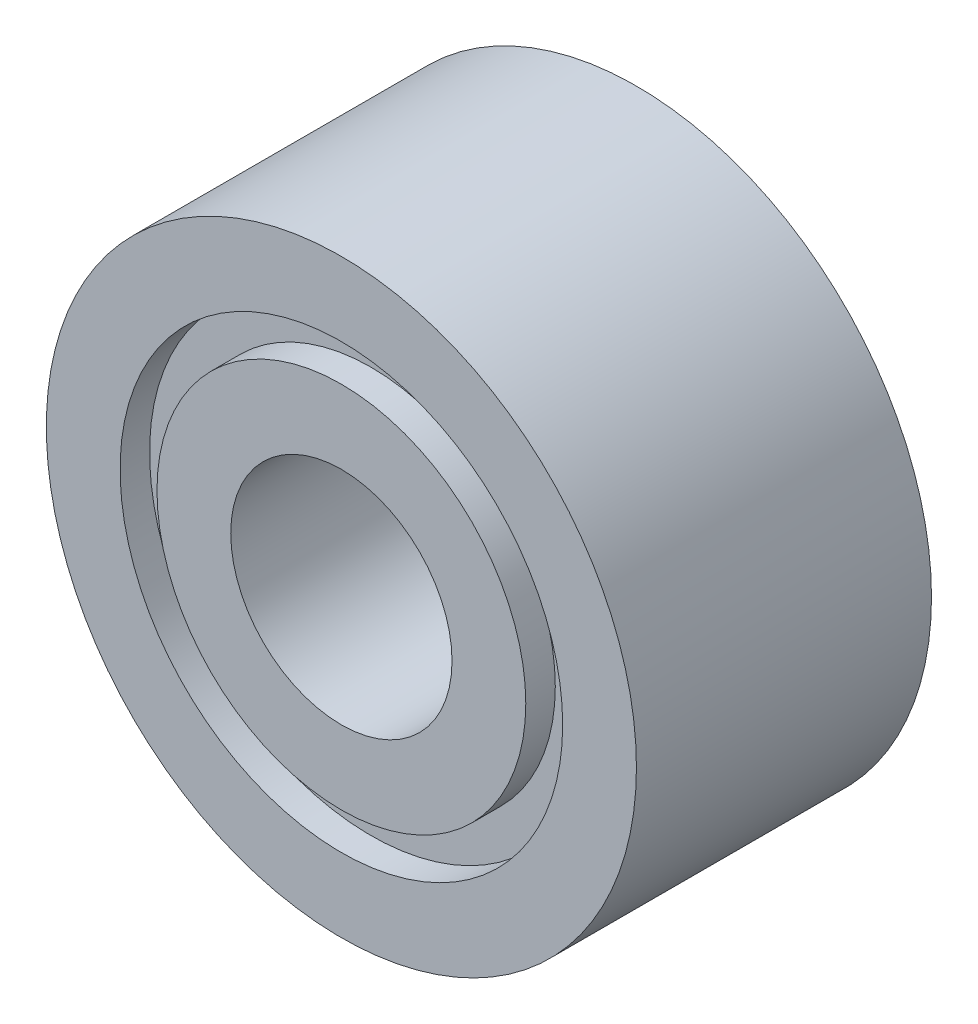
ISO-10303-21;
HEADER;
FILE_DESCRIPTION(('STEP AP214'),'2;1');
FILE_NAME('part.step','',(''),(''),'','','');
FILE_SCHEMA(('AUTOMOTIVE_DESIGN { 1 0 10303 214 1 1 1 1 }'));
ENDSEC;
DATA;
#1=APPLICATION_CONTEXT('core data for automotive mechanical design processes');
#2=APPLICATION_PROTOCOL_DEFINITION('international standard','automotive_design',2000,#1);
#3=PRODUCT_CONTEXT('',#1,'mechanical');
#4=PRODUCT('Part','Part','',(#3));
#5=PRODUCT_RELATED_PRODUCT_CATEGORY('part','',(#4));
#6=PRODUCT_DEFINITION_FORMATION('','',#4);
#7=PRODUCT_DEFINITION_CONTEXT('part definition',#1,'design');
#8=PRODUCT_DEFINITION('design','',#6,#7);
#9=PRODUCT_DEFINITION_SHAPE('','',#8);
#10=(LENGTH_UNIT() NAMED_UNIT(*) SI_UNIT(.MILLI.,.METRE.));
#11=(NAMED_UNIT(*) PLANE_ANGLE_UNIT() SI_UNIT($,.RADIAN.));
#12=(NAMED_UNIT(*) SI_UNIT($,.STERADIAN.) SOLID_ANGLE_UNIT());
#13=UNCERTAINTY_MEASURE_WITH_UNIT(LENGTH_MEASURE(1.E-05),#10,'distance_accuracy_value','');
#14=(GEOMETRIC_REPRESENTATION_CONTEXT(3) GLOBAL_UNCERTAINTY_ASSIGNED_CONTEXT((#13)) GLOBAL_UNIT_ASSIGNED_CONTEXT((#10,
#11,#12)) REPRESENTATION_CONTEXT('',''));
#15=CARTESIAN_POINT('',(0.,0.,0.));
#16=DIRECTION('',(0.,0.,1.));
#17=DIRECTION('',(1.,0.,0.));
#18=AXIS2_PLACEMENT_3D('',#15,#16,#17);
#19=CARTESIAN_POINT('',(0.,1.5,-1.10919002990261));
#20=DIRECTION('',(0.,0.,-1.));
#21=DIRECTION('',(-1.,0.,0.));
#22=AXIS2_PLACEMENT_3D('',#19,#20,#21);
#23=PLANE('',#22);
#24=CARTESIAN_POINT('',(0.,0.,-1.10919002990261));
#25=DIRECTION('',(0.,0.,1.));
#26=DIRECTION('',(1.,0.,0.));
#27=AXIS2_PLACEMENT_3D('',#24,#25,#26);
#28=CIRCLE('',#27,1.5);
#29=CARTESIAN_POINT('',(1.5,0.,-1.10919002990261));
#30=VERTEX_POINT('',#29);
#31=EDGE_CURVE('E90',#30,#30,#28,.T.);
#32=ORIENTED_EDGE('',*,*,#31,.F.);
#33=EDGE_LOOP('',(#32));
#34=FACE_BOUND('',#33,.T.);
#35=CARTESIAN_POINT('',(0.,0.,-1.10919002990261));
#36=DIRECTION('',(0.,0.,1.));
#37=DIRECTION('',(1.,0.,0.));
#38=AXIS2_PLACEMENT_3D('',#35,#36,#37);
#39=CIRCLE('',#38,2.);
#40=CARTESIAN_POINT('',(2.,0.,-1.10919002990261));
#41=VERTEX_POINT('',#40);
#42=EDGE_CURVE('E10',#41,#41,#39,.T.);
#43=ORIENTED_EDGE('',*,*,#42,.T.);
#44=EDGE_LOOP('',(#43));
#45=FACE_BOUND('',#44,.T.);
#46=ADVANCED_FACE('F39',(#34,#45),#23,.F.);
#47=CARTESIAN_POINT('',(0.,0.,0.));
#48=DIRECTION('',(0.,0.,1.));
#49=DIRECTION('',(1.,0.,0.));
#50=AXIS2_PLACEMENT_3D('',#47,#48,#49);
#51=CYLINDRICAL_SURFACE('',#50,2.);
#52=ORIENTED_EDGE('',*,*,#42,.F.);
#53=EDGE_LOOP('',(#52));
#54=FACE_BOUND('',#53,.T.);
#55=CARTESIAN_POINT('',(0.,0.,-3.10919002990261));
#56=DIRECTION('',(0.,0.,1.));
#57=DIRECTION('',(1.,0.,0.));
#58=AXIS2_PLACEMENT_3D('',#55,#56,#57);
#59=CIRCLE('',#58,2.);
#60=CARTESIAN_POINT('',(2.,0.,-3.10919002990261));
#61=VERTEX_POINT('',#60);
#62=EDGE_CURVE('E46',#61,#61,#59,.T.);
#63=ORIENTED_EDGE('',*,*,#62,.T.);
#64=EDGE_LOOP('',(#63));
#65=FACE_BOUND('',#64,.T.);
#66=ADVANCED_FACE('F98',(#54,#65),#51,.T.);
#67=CARTESIAN_POINT('',(0.,2.,-3.10919002990261));
#68=DIRECTION('',(0.,0.,1.));
#69=DIRECTION('',(1.,0.,0.));
#70=AXIS2_PLACEMENT_3D('',#67,#68,#69);
#71=PLANE('',#70);
#72=ORIENTED_EDGE('',*,*,#62,.F.);
#73=EDGE_LOOP('',(#72));
#74=FACE_BOUND('',#73,.T.);
#75=CARTESIAN_POINT('',(0.,0.,-3.10919002990261));
#76=DIRECTION('',(0.,0.,1.));
#77=DIRECTION('',(1.,0.,0.));
#78=AXIS2_PLACEMENT_3D('',#75,#76,#77);
#79=CIRCLE('',#78,1.5);
#80=CARTESIAN_POINT('',(1.5,0.,-3.10919002990261));
#81=VERTEX_POINT('',#80);
#82=EDGE_CURVE('E51',#81,#81,#79,.T.);
#83=ORIENTED_EDGE('',*,*,#82,.T.);
#84=EDGE_LOOP('',(#83));
#85=FACE_BOUND('',#84,.T.);
#86=ADVANCED_FACE('F102',(#74,#85),#71,.F.);
#87=CARTESIAN_POINT('',(0.,0.,0.));
#88=DIRECTION('',(0.,0.,1.));
#89=DIRECTION('',(1.,0.,0.));
#90=AXIS2_PLACEMENT_3D('',#87,#88,#89);
#91=CYLINDRICAL_SURFACE('',#90,1.5);
#92=ORIENTED_EDGE('',*,*,#82,.F.);
#93=EDGE_LOOP('',(#92));
#94=FACE_BOUND('',#93,.T.);
#95=CARTESIAN_POINT('',(0.,0.,-2.90919002990261));
#96=DIRECTION('',(0.,0.,1.));
#97=DIRECTION('',(1.,0.,0.));
#98=AXIS2_PLACEMENT_3D('',#95,#96,#97);
#99=CIRCLE('',#98,1.5);
#100=CARTESIAN_POINT('',(1.5,0.,-2.90919002990261));
#101=VERTEX_POINT('',#100);
#102=EDGE_CURVE('E56',#101,#101,#99,.T.);
#103=ORIENTED_EDGE('',*,*,#102,.T.);
#104=EDGE_LOOP('',(#103));
#105=FACE_BOUND('',#104,.T.);
#106=ADVANCED_FACE('F107',(#94,#105),#91,.F.);
#107=CARTESIAN_POINT('',(0.,1.5,-2.90919002990261));
#108=DIRECTION('',(0.,0.,1.));
#109=DIRECTION('',(1.,0.,0.));
#110=AXIS2_PLACEMENT_3D('',#107,#108,#109);
#111=PLANE('',#110);
#112=ORIENTED_EDGE('',*,*,#102,.F.);
#113=EDGE_LOOP('',(#112));
#114=FACE_BOUND('',#113,.T.);
#115=CARTESIAN_POINT('',(0.,0.,-2.90919002990261));
#116=DIRECTION('',(0.,0.,1.));
#117=DIRECTION('',(1.,0.,0.));
#118=AXIS2_PLACEMENT_3D('',#115,#116,#117);
#119=CIRCLE('',#118,1.25);
#120=CARTESIAN_POINT('',(1.25,0.,-2.90919002990261));
#121=VERTEX_POINT('',#120);
#122=EDGE_CURVE('E62',#121,#121,#119,.T.);
#123=ORIENTED_EDGE('',*,*,#122,.T.);
#124=EDGE_LOOP('',(#123));
#125=FACE_BOUND('',#124,.T.);
#126=ADVANCED_FACE('F113',(#114,#125),#111,.F.);
#127=CARTESIAN_POINT('',(0.,0.,0.));
#128=DIRECTION('',(0.,0.,1.));
#129=DIRECTION('',(1.,0.,0.));
#130=AXIS2_PLACEMENT_3D('',#127,#128,#129);
#131=CYLINDRICAL_SURFACE('',#130,1.25);
#132=ORIENTED_EDGE('',*,*,#122,.F.);
#133=EDGE_LOOP('',(#132));
#134=FACE_BOUND('',#133,.T.);
#135=CARTESIAN_POINT('',(0.,0.,-3.10919002990261));
#136=DIRECTION('',(0.,0.,1.));
#137=DIRECTION('',(1.,0.,0.));
#138=AXIS2_PLACEMENT_3D('',#135,#136,#137);
#139=CIRCLE('',#138,1.25);
#140=CARTESIAN_POINT('',(1.25,0.,-3.10919002990261));
#141=VERTEX_POINT('',#140);
#142=EDGE_CURVE('E66',#141,#141,#139,.T.);
#143=ORIENTED_EDGE('',*,*,#142,.T.);
#144=EDGE_LOOP('',(#143));
#145=FACE_BOUND('',#144,.T.);
#146=ADVANCED_FACE('F117',(#134,#145),#131,.T.);
#147=CARTESIAN_POINT('',(0.,1.25,-3.10919002990261));
#148=DIRECTION('',(0.,0.,1.));
#149=DIRECTION('',(1.,0.,0.));
#150=AXIS2_PLACEMENT_3D('',#147,#148,#149);
#151=PLANE('',#150);
#152=ORIENTED_EDGE('',*,*,#142,.F.);
#153=EDGE_LOOP('',(#152));
#154=FACE_BOUND('',#153,.T.);
#155=CARTESIAN_POINT('',(0.,0.,-3.10919002990261));
#156=DIRECTION('',(0.,0.,1.));
#157=DIRECTION('',(1.,0.,0.));
#158=AXIS2_PLACEMENT_3D('',#155,#156,#157);
#159=CIRCLE('',#158,0.75);
#160=CARTESIAN_POINT('',(0.75,0.,-3.10919002990261));
#161=VERTEX_POINT('',#160);
#162=EDGE_CURVE('E70',#161,#161,#159,.T.);
#163=ORIENTED_EDGE('',*,*,#162,.T.);
#164=EDGE_LOOP('',(#163));
#165=FACE_BOUND('',#164,.T.);
#166=ADVANCED_FACE('F121',(#154,#165),#151,.F.);
#167=CARTESIAN_POINT('',(0.,0.,0.));
#168=DIRECTION('',(0.,0.,1.));
#169=DIRECTION('',(1.,0.,0.));
#170=AXIS2_PLACEMENT_3D('',#167,#168,#169);
#171=CYLINDRICAL_SURFACE('',#170,0.75);
#172=ORIENTED_EDGE('',*,*,#162,.F.);
#173=EDGE_LOOP('',(#172));
#174=FACE_BOUND('',#173,.T.);
#175=CARTESIAN_POINT('',(0.,0.,-1.10919002990261));
#176=DIRECTION('',(0.,0.,1.));
#177=DIRECTION('',(1.,0.,0.));
#178=AXIS2_PLACEMENT_3D('',#175,#176,#177);
#179=CIRCLE('',#178,0.75);
#180=CARTESIAN_POINT('',(0.75,0.,-1.10919002990261));
#181=VERTEX_POINT('',#180);
#182=EDGE_CURVE('E74',#181,#181,#179,.T.);
#183=ORIENTED_EDGE('',*,*,#182,.T.);
#184=EDGE_LOOP('',(#183));
#185=FACE_BOUND('',#184,.T.);
#186=ADVANCED_FACE('F125',(#174,#185),#171,.F.);
#187=CARTESIAN_POINT('',(0.,0.75,-1.10919002990261));
#188=DIRECTION('',(0.,0.,-1.));
#189=DIRECTION('',(-1.,0.,0.));
#190=AXIS2_PLACEMENT_3D('',#187,#188,#189);
#191=PLANE('',#190);
#192=ORIENTED_EDGE('',*,*,#182,.F.);
#193=EDGE_LOOP('',(#192));
#194=FACE_BOUND('',#193,.T.);
#195=CARTESIAN_POINT('',(0.,0.,-1.10919002990261));
#196=DIRECTION('',(0.,0.,1.));
#197=DIRECTION('',(1.,0.,0.));
#198=AXIS2_PLACEMENT_3D('',#195,#196,#197);
#199=CIRCLE('',#198,1.25);
#200=CARTESIAN_POINT('',(1.25,0.,-1.10919002990261));
#201=VERTEX_POINT('',#200);
#202=EDGE_CURVE('E78',#201,#201,#199,.T.);
#203=ORIENTED_EDGE('',*,*,#202,.T.);
#204=EDGE_LOOP('',(#203));
#205=FACE_BOUND('',#204,.T.);
#206=ADVANCED_FACE('F129',(#194,#205),#191,.F.);
#207=CARTESIAN_POINT('',(0.,0.,0.));
#208=DIRECTION('',(0.,0.,1.));
#209=DIRECTION('',(1.,0.,0.));
#210=AXIS2_PLACEMENT_3D('',#207,#208,#209);
#211=CYLINDRICAL_SURFACE('',#210,1.25);
#212=ORIENTED_EDGE('',*,*,#202,.F.);
#213=EDGE_LOOP('',(#212));
#214=FACE_BOUND('',#213,.T.);
#215=CARTESIAN_POINT('',(0.,0.,-1.30919002990261));
#216=DIRECTION('',(0.,0.,1.));
#217=DIRECTION('',(1.,0.,0.));
#218=AXIS2_PLACEMENT_3D('',#215,#216,#217);
#219=CIRCLE('',#218,1.25);
#220=CARTESIAN_POINT('',(1.25,0.,-1.30919002990261));
#221=VERTEX_POINT('',#220);
#222=EDGE_CURVE('E82',#221,#221,#219,.T.);
#223=ORIENTED_EDGE('',*,*,#222,.T.);
#224=EDGE_LOOP('',(#223));
#225=FACE_BOUND('',#224,.T.);
#226=ADVANCED_FACE('F133',(#214,#225),#211,.T.);
#227=CARTESIAN_POINT('',(0.,1.25,-1.30919002990261));
#228=DIRECTION('',(0.,0.,-1.));
#229=DIRECTION('',(-1.,0.,0.));
#230=AXIS2_PLACEMENT_3D('',#227,#228,#229);
#231=PLANE('',#230);
#232=ORIENTED_EDGE('',*,*,#222,.F.);
#233=EDGE_LOOP('',(#232));
#234=FACE_BOUND('',#233,.T.);
#235=CARTESIAN_POINT('',(0.,0.,-1.30919002990261));
#236=DIRECTION('',(0.,0.,1.));
#237=DIRECTION('',(1.,0.,0.));
#238=AXIS2_PLACEMENT_3D('',#235,#236,#237);
#239=CIRCLE('',#238,1.5);
#240=CARTESIAN_POINT('',(1.5,0.,-1.30919002990261));
#241=VERTEX_POINT('',#240);
#242=EDGE_CURVE('E86',#241,#241,#239,.T.);
#243=ORIENTED_EDGE('',*,*,#242,.T.);
#244=EDGE_LOOP('',(#243));
#245=FACE_BOUND('',#244,.T.);
#246=ADVANCED_FACE('F137',(#234,#245),#231,.F.);
#247=CARTESIAN_POINT('',(0.,0.,0.));
#248=DIRECTION('',(0.,0.,1.));
#249=DIRECTION('',(1.,0.,0.));
#250=AXIS2_PLACEMENT_3D('',#247,#248,#249);
#251=CYLINDRICAL_SURFACE('',#250,1.5);
#252=ORIENTED_EDGE('',*,*,#242,.F.);
#253=EDGE_LOOP('',(#252));
#254=FACE_BOUND('',#253,.T.);
#255=ORIENTED_EDGE('',*,*,#31,.T.);
#256=EDGE_LOOP('',(#255));
#257=FACE_BOUND('',#256,.T.);
#258=ADVANCED_FACE('F95',(#254,#257),#251,.F.);
#259=CLOSED_SHELL('',(#46,#66,#86,#106,#126,#146,#166,#186,#206,#226,#246,#258));
#260=MANIFOLD_SOLID_BREP('B2',#259);
#261=ADVANCED_BREP_SHAPE_REPRESENTATION('',(#18,#260),#14);
#262=SHAPE_DEFINITION_REPRESENTATION(#9,#261);
ENDSEC;
END-ISO-10303-21;
